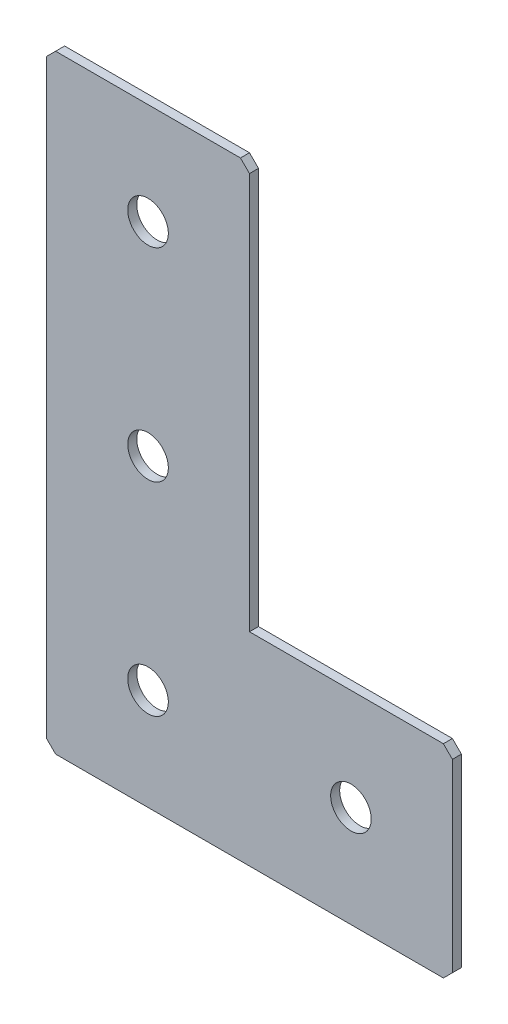
ISO-10303-21;
HEADER;
FILE_DESCRIPTION(('STEP AP214'),'2;1');
FILE_NAME('part.step','',(''),(''),'','','');
FILE_SCHEMA(('AUTOMOTIVE_DESIGN { 1 0 10303 214 1 1 1 1 }'));
ENDSEC;
DATA;
#1=APPLICATION_CONTEXT('core data for automotive mechanical design processes');
#2=APPLICATION_PROTOCOL_DEFINITION('international standard','automotive_design',2000,#1);
#3=PRODUCT_CONTEXT('',#1,'mechanical');
#4=PRODUCT('Part','Part','',(#3));
#5=PRODUCT_RELATED_PRODUCT_CATEGORY('part','',(#4));
#6=PRODUCT_DEFINITION_FORMATION('','',#4);
#7=PRODUCT_DEFINITION_CONTEXT('part definition',#1,'design');
#8=PRODUCT_DEFINITION('design','',#6,#7);
#9=PRODUCT_DEFINITION_SHAPE('','',#8);
#10=(LENGTH_UNIT() NAMED_UNIT(*) SI_UNIT(.MILLI.,.METRE.));
#11=(NAMED_UNIT(*) PLANE_ANGLE_UNIT() SI_UNIT($,.RADIAN.));
#12=(NAMED_UNIT(*) SI_UNIT($,.STERADIAN.) SOLID_ANGLE_UNIT());
#13=UNCERTAINTY_MEASURE_WITH_UNIT(LENGTH_MEASURE(1.E-05),#10,'distance_accuracy_value','');
#14=(GEOMETRIC_REPRESENTATION_CONTEXT(3) GLOBAL_UNCERTAINTY_ASSIGNED_CONTEXT((#13)) GLOBAL_UNIT_ASSIGNED_CONTEXT((#10,
#11,#12)) REPRESENTATION_CONTEXT('',''));
#15=CARTESIAN_POINT('',(0.,0.,0.));
#16=DIRECTION('',(0.,0.,1.));
#17=DIRECTION('',(1.,0.,0.));
#18=AXIS2_PLACEMENT_3D('',#15,#16,#17);
#19=CARTESIAN_POINT('',(45.,0.,-2.));
#20=DIRECTION('',(0.,-1.,0.));
#21=DIRECTION('',(1.,0.,0.));
#22=AXIS2_PLACEMENT_3D('',#19,#20,#21);
#23=PLANE('',#22);
#24=DIRECTION('',(1.,0.,0.));
#25=VECTOR('',#24,1.);
#26=CARTESIAN_POINT('',(45.,0.,-2.));
#27=LINE('',#26,#25);
#28=CARTESIAN_POINT('',(2.,0.,-2.));
#29=VERTEX_POINT('',#28);
#30=CARTESIAN_POINT('',(43.,0.,-2.));
#31=VERTEX_POINT('',#30);
#32=EDGE_CURVE('E143',#29,#31,#27,.T.);
#33=ORIENTED_EDGE('',*,*,#32,.F.);
#34=DIRECTION('',(0.,0.,1.));
#35=VECTOR('',#34,1.);
#36=CARTESIAN_POINT('',(1.99999999999999,0.,-2.));
#37=LINE('',#36,#35);
#38=CARTESIAN_POINT('',(2.,0.,0.));
#39=VERTEX_POINT('',#38);
#40=EDGE_CURVE('E197',#29,#39,#37,.T.);
#41=ORIENTED_EDGE('',*,*,#40,.T.);
#42=DIRECTION('',(1.,0.,0.));
#43=VECTOR('',#42,1.);
#44=CARTESIAN_POINT('',(45.,0.,0.));
#45=LINE('',#44,#43);
#46=CARTESIAN_POINT('',(43.,0.,0.));
#47=VERTEX_POINT('',#46);
#48=EDGE_CURVE('E174',#39,#47,#45,.T.);
#49=ORIENTED_EDGE('',*,*,#48,.T.);
#50=DIRECTION('',(0.,0.,-1.));
#51=VECTOR('',#50,1.);
#52=CARTESIAN_POINT('',(43.,0.,-2.));
#53=LINE('',#52,#51);
#54=EDGE_CURVE('E154',#47,#31,#53,.T.);
#55=ORIENTED_EDGE('',*,*,#54,.T.);
#56=EDGE_LOOP('',(#33,#41,#49,#55));
#57=FACE_BOUND('',#56,.T.);
#58=ADVANCED_FACE('F45',(#57),#23,.F.);
#59=CARTESIAN_POINT('',(45.,-90.,-2.));
#60=DIRECTION('',(-1.,0.,0.));
#61=DIRECTION('',(0.,-1.,0.));
#62=AXIS2_PLACEMENT_3D('',#59,#60,#61);
#63=PLANE('',#62);
#64=DIRECTION('',(0.,-1.,0.));
#65=VECTOR('',#64,1.);
#66=CARTESIAN_POINT('',(45.,-90.,-2.));
#67=LINE('',#66,#65);
#68=CARTESIAN_POINT('',(45.,-2.00000000000003,-2.));
#69=VERTEX_POINT('',#68);
#70=CARTESIAN_POINT('',(45.,-90.,-2.));
#71=VERTEX_POINT('',#70);
#72=EDGE_CURVE('E129',#69,#71,#67,.T.);
#73=ORIENTED_EDGE('',*,*,#72,.F.);
#74=DIRECTION('',(0.,0.,1.));
#75=VECTOR('',#74,1.);
#76=CARTESIAN_POINT('',(45.,-2.,-2.));
#77=LINE('',#76,#75);
#78=CARTESIAN_POINT('',(45.,-2.00000000000003,0.));
#79=VERTEX_POINT('',#78);
#80=EDGE_CURVE('E236',#69,#79,#77,.T.);
#81=ORIENTED_EDGE('',*,*,#80,.T.);
#82=DIRECTION('',(0.,-1.,0.));
#83=VECTOR('',#82,1.);
#84=CARTESIAN_POINT('',(45.,-90.,0.));
#85=LINE('',#84,#83);
#86=CARTESIAN_POINT('',(45.,-90.,0.));
#87=VERTEX_POINT('',#86);
#88=EDGE_CURVE('E149',#79,#87,#85,.T.);
#89=ORIENTED_EDGE('',*,*,#88,.T.);
#90=DIRECTION('',(0.,0.,1.));
#91=VECTOR('',#90,1.);
#92=CARTESIAN_POINT('',(45.,-90.,-2.));
#93=LINE('',#92,#91);
#94=EDGE_CURVE('E146',#71,#87,#93,.T.);
#95=ORIENTED_EDGE('',*,*,#94,.F.);
#96=EDGE_LOOP('',(#73,#81,#89,#95));
#97=FACE_BOUND('',#96,.T.);
#98=ADVANCED_FACE('F147',(#97),#63,.F.);
#99=CARTESIAN_POINT('',(90.,-90.,-2.));
#100=DIRECTION('',(0.,-1.,0.));
#101=DIRECTION('',(0.,0.,-1.));
#102=AXIS2_PLACEMENT_3D('',#99,#100,#101);
#103=PLANE('',#102);
#104=DIRECTION('',(1.,0.,0.));
#105=VECTOR('',#104,1.);
#106=CARTESIAN_POINT('',(90.,-90.,0.));
#107=LINE('',#106,#105);
#108=CARTESIAN_POINT('',(88.,-90.,0.));
#109=VERTEX_POINT('',#108);
#110=EDGE_CURVE('E181',#87,#109,#107,.T.);
#111=ORIENTED_EDGE('',*,*,#110,.T.);
#112=DIRECTION('',(0.,0.,-1.));
#113=VECTOR('',#112,1.);
#114=CARTESIAN_POINT('',(88.,-90.,-2.));
#115=LINE('',#114,#113);
#116=CARTESIAN_POINT('',(88.,-90.,-2.));
#117=VERTEX_POINT('',#116);
#118=EDGE_CURVE('E159',#109,#117,#115,.T.);
#119=ORIENTED_EDGE('',*,*,#118,.T.);
#120=DIRECTION('',(1.,0.,0.));
#121=VECTOR('',#120,1.);
#122=CARTESIAN_POINT('',(90.,-90.,-2.));
#123=LINE('',#122,#121);
#124=EDGE_CURVE('E134',#71,#117,#123,.T.);
#125=ORIENTED_EDGE('',*,*,#124,.F.);
#126=ORIENTED_EDGE('',*,*,#94,.T.);
#127=EDGE_LOOP('',(#111,#119,#125,#126));
#128=FACE_BOUND('',#127,.T.);
#129=ADVANCED_FACE('F157',(#128),#103,.F.);
#130=CARTESIAN_POINT('',(90.,-135.,-2.));
#131=DIRECTION('',(-1.,0.,0.));
#132=DIRECTION('',(0.,0.,1.));
#133=AXIS2_PLACEMENT_3D('',#130,#131,#132);
#134=PLANE('',#133);
#135=DIRECTION('',(0.,-1.,0.));
#136=VECTOR('',#135,1.);
#137=CARTESIAN_POINT('',(90.,-135.,-2.));
#138=LINE('',#137,#136);
#139=CARTESIAN_POINT('',(90.,-92.,-2.));
#140=VERTEX_POINT('',#139);
#141=CARTESIAN_POINT('',(90.,-133.,-2.));
#142=VERTEX_POINT('',#141);
#143=EDGE_CURVE('E161',#140,#142,#138,.T.);
#144=ORIENTED_EDGE('',*,*,#143,.F.);
#145=DIRECTION('',(0.,0.,1.));
#146=VECTOR('',#145,1.);
#147=CARTESIAN_POINT('',(90.,-92.,-2.));
#148=LINE('',#147,#146);
#149=CARTESIAN_POINT('',(90.,-92.,0.));
#150=VERTEX_POINT('',#149);
#151=EDGE_CURVE('E242',#140,#150,#148,.T.);
#152=ORIENTED_EDGE('',*,*,#151,.T.);
#153=DIRECTION('',(0.,-1.,0.));
#154=VECTOR('',#153,1.);
#155=CARTESIAN_POINT('',(90.,-135.,0.));
#156=LINE('',#155,#154);
#157=CARTESIAN_POINT('',(90.,-133.,0.));
#158=VERTEX_POINT('',#157);
#159=EDGE_CURVE('E184',#150,#158,#156,.T.);
#160=ORIENTED_EDGE('',*,*,#159,.T.);
#161=DIRECTION('',(0.,0.,-1.));
#162=VECTOR('',#161,1.);
#163=CARTESIAN_POINT('',(90.,-133.,-2.));
#164=LINE('',#163,#162);
#165=EDGE_CURVE('E239',#158,#142,#164,.T.);
#166=ORIENTED_EDGE('',*,*,#165,.T.);
#167=EDGE_LOOP('',(#144,#152,#160,#166));
#168=FACE_BOUND('',#167,.T.);
#169=ADVANCED_FACE('F376',(#168),#134,.F.);
#170=CARTESIAN_POINT('',(0.,-135.,-2.));
#171=DIRECTION('',(0.,1.,0.));
#172=DIRECTION('',(0.,0.,1.));
#173=AXIS2_PLACEMENT_3D('',#170,#171,#172);
#174=PLANE('',#173);
#175=DIRECTION('',(-1.,0.,0.));
#176=VECTOR('',#175,1.);
#177=CARTESIAN_POINT('',(0.,-135.,-2.));
#178=LINE('',#177,#176);
#179=CARTESIAN_POINT('',(88.,-135.,-2.));
#180=VERTEX_POINT('',#179);
#181=CARTESIAN_POINT('',(2.,-135.,-2.));
#182=VERTEX_POINT('',#181);
#183=EDGE_CURVE('E166',#180,#182,#178,.T.);
#184=ORIENTED_EDGE('',*,*,#183,.F.);
#185=DIRECTION('',(0.,0.,1.));
#186=VECTOR('',#185,1.);
#187=CARTESIAN_POINT('',(88.,-135.,-2.));
#188=LINE('',#187,#186);
#189=CARTESIAN_POINT('',(88.,-135.,0.));
#190=VERTEX_POINT('',#189);
#191=EDGE_CURVE('E11',#180,#190,#188,.T.);
#192=ORIENTED_EDGE('',*,*,#191,.T.);
#193=DIRECTION('',(-1.,0.,0.));
#194=VECTOR('',#193,1.);
#195=CARTESIAN_POINT('',(0.,-135.,0.));
#196=LINE('',#195,#194);
#197=CARTESIAN_POINT('',(2.,-135.,0.));
#198=VERTEX_POINT('',#197);
#199=EDGE_CURVE('E188',#190,#198,#196,.T.);
#200=ORIENTED_EDGE('',*,*,#199,.T.);
#201=DIRECTION('',(0.,0.,-1.));
#202=VECTOR('',#201,1.);
#203=CARTESIAN_POINT('',(2.,-135.,-2.));
#204=LINE('',#203,#202);
#205=EDGE_CURVE('E54',#198,#182,#204,.T.);
#206=ORIENTED_EDGE('',*,*,#205,.T.);
#207=EDGE_LOOP('',(#184,#192,#200,#206));
#208=FACE_BOUND('',#207,.T.);
#209=ADVANCED_FACE('F382',(#208),#174,.F.);
#210=CARTESIAN_POINT('',(0.,0.,-2.));
#211=DIRECTION('',(1.,0.,0.));
#212=DIRECTION('',(0.,0.,-1.));
#213=AXIS2_PLACEMENT_3D('',#210,#211,#212);
#214=PLANE('',#213);
#215=DIRECTION('',(0.,1.,0.));
#216=VECTOR('',#215,1.);
#217=CARTESIAN_POINT('',(0.,0.,0.));
#218=LINE('',#217,#216);
#219=CARTESIAN_POINT('',(0.,-133.,0.));
#220=VERTEX_POINT('',#219);
#221=CARTESIAN_POINT('',(0.,-2.,0.));
#222=VERTEX_POINT('',#221);
#223=EDGE_CURVE('E191',#220,#222,#218,.T.);
#224=ORIENTED_EDGE('',*,*,#223,.T.);
#225=DIRECTION('',(0.,0.,-1.));
#226=VECTOR('',#225,1.);
#227=CARTESIAN_POINT('',(0.,-2.,-2.));
#228=LINE('',#227,#226);
#229=CARTESIAN_POINT('',(0.,-2.,-2.));
#230=VERTEX_POINT('',#229);
#231=EDGE_CURVE('E220',#222,#230,#228,.T.);
#232=ORIENTED_EDGE('',*,*,#231,.T.);
#233=DIRECTION('',(0.,1.,0.));
#234=VECTOR('',#233,1.);
#235=CARTESIAN_POINT('',(0.,0.,-2.));
#236=LINE('',#235,#234);
#237=CARTESIAN_POINT('',(0.,-133.,-2.));
#238=VERTEX_POINT('',#237);
#239=EDGE_CURVE('E155',#238,#230,#236,.T.);
#240=ORIENTED_EDGE('',*,*,#239,.F.);
#241=DIRECTION('',(0.,0.,1.));
#242=VECTOR('',#241,1.);
#243=CARTESIAN_POINT('',(0.,-133.,-2.));
#244=LINE('',#243,#242);
#245=EDGE_CURVE('E216',#238,#220,#244,.T.);
#246=ORIENTED_EDGE('',*,*,#245,.T.);
#247=EDGE_LOOP('',(#224,#232,#240,#246));
#248=FACE_BOUND('',#247,.T.);
#249=ADVANCED_FACE('F389',(#248),#214,.F.);
#250=CARTESIAN_POINT('',(0.,0.,-2.));
#251=DIRECTION('',(0.,0.,1.));
#252=DIRECTION('',(1.,0.,0.));
#253=AXIS2_PLACEMENT_3D('',#250,#251,#252);
#254=PLANE('',#253);
#255=CARTESIAN_POINT('',(67.5,-112.5,-2.00000000000001));
#256=DIRECTION('',(0.,0.,-1.));
#257=DIRECTION('',(0.,1.,0.));
#258=AXIS2_PLACEMENT_3D('',#255,#256,#257);
#259=CIRCLE('',#258,4.5);
#260=CARTESIAN_POINT('',(67.5,-108.,-2.00000000000001));
#261=VERTEX_POINT('',#260);
#262=EDGE_CURVE('E311',#261,#261,#259,.T.);
#263=ORIENTED_EDGE('',*,*,#262,.F.);
#264=EDGE_LOOP('',(#263));
#265=FACE_BOUND('',#264,.T.);
#266=CARTESIAN_POINT('',(22.5,-112.5,-2.00000000000001));
#267=DIRECTION('',(0.,0.,-1.));
#268=DIRECTION('',(0.,1.,0.));
#269=AXIS2_PLACEMENT_3D('',#266,#267,#268);
#270=CIRCLE('',#269,4.5);
#271=CARTESIAN_POINT('',(22.5,-108.,-2.00000000000001));
#272=VERTEX_POINT('',#271);
#273=EDGE_CURVE('E322',#272,#272,#270,.T.);
#274=ORIENTED_EDGE('',*,*,#273,.F.);
#275=EDGE_LOOP('',(#274));
#276=FACE_BOUND('',#275,.T.);
#277=CARTESIAN_POINT('',(22.5,-67.5,-2.));
#278=DIRECTION('',(0.,0.,-1.));
#279=DIRECTION('',(0.,1.,0.));
#280=AXIS2_PLACEMENT_3D('',#277,#278,#279);
#281=CIRCLE('',#280,4.5);
#282=CARTESIAN_POINT('',(22.5,-63.,-2.));
#283=VERTEX_POINT('',#282);
#284=EDGE_CURVE('E333',#283,#283,#281,.T.);
#285=ORIENTED_EDGE('',*,*,#284,.F.);
#286=EDGE_LOOP('',(#285));
#287=FACE_BOUND('',#286,.T.);
#288=CARTESIAN_POINT('',(22.5,-22.5,-2.));
#289=DIRECTION('',(0.,0.,-1.));
#290=DIRECTION('',(0.,1.,0.));
#291=AXIS2_PLACEMENT_3D('',#288,#289,#290);
#292=CIRCLE('',#291,4.5);
#293=CARTESIAN_POINT('',(22.5,-18.,-2.));
#294=VERTEX_POINT('',#293);
#295=EDGE_CURVE('E343',#294,#294,#292,.T.);
#296=ORIENTED_EDGE('',*,*,#295,.F.);
#297=EDGE_LOOP('',(#296));
#298=FACE_BOUND('',#297,.T.);
#299=ORIENTED_EDGE('',*,*,#239,.T.);
#300=DIRECTION('',(-0.707106781186545,-0.70710678118655,0.));
#301=VECTOR('',#300,1.);
#302=CARTESIAN_POINT('',(1.99999999999999,0.,-2.));
#303=LINE('',#302,#301);
#304=EDGE_CURVE('E233',#230,#29,#303,.F.);
#305=ORIENTED_EDGE('',*,*,#304,.T.);
#306=ORIENTED_EDGE('',*,*,#32,.T.);
#307=DIRECTION('',(-0.70710678118655,0.707106781186545,0.));
#308=VECTOR('',#307,1.);
#309=CARTESIAN_POINT('',(45.,-2.,-2.));
#310=LINE('',#309,#308);
#311=EDGE_CURVE('E138',#31,#69,#310,.F.);
#312=ORIENTED_EDGE('',*,*,#311,.T.);
#313=ORIENTED_EDGE('',*,*,#72,.T.);
#314=ORIENTED_EDGE('',*,*,#124,.T.);
#315=DIRECTION('',(-0.707106781186552,0.707106781186543,0.));
#316=VECTOR('',#315,1.);
#317=CARTESIAN_POINT('',(90.,-92.,-2.));
#318=LINE('',#317,#316);
#319=EDGE_CURVE('E228',#117,#140,#318,.F.);
#320=ORIENTED_EDGE('',*,*,#319,.T.);
#321=ORIENTED_EDGE('',*,*,#143,.T.);
#322=DIRECTION('',(0.707106781186543,0.707106781186552,0.));
#323=VECTOR('',#322,1.);
#324=CARTESIAN_POINT('',(88.,-135.,-2.));
#325=LINE('',#324,#323);
#326=EDGE_CURVE('E67',#142,#180,#325,.F.);
#327=ORIENTED_EDGE('',*,*,#326,.T.);
#328=ORIENTED_EDGE('',*,*,#183,.T.);
#329=DIRECTION('',(0.707106781186548,-0.707106781186548,0.));
#330=VECTOR('',#329,1.);
#331=CARTESIAN_POINT('',(0.,-133.,-2.));
#332=LINE('',#331,#330);
#333=EDGE_CURVE('E223',#182,#238,#332,.F.);
#334=ORIENTED_EDGE('',*,*,#333,.T.);
#335=EDGE_LOOP('',(#299,#305,#306,#312,#313,#314,#320,#321,#327,#328,#334));
#336=FACE_BOUND('',#335,.T.);
#337=ADVANCED_FACE('F132',(#265,#276,#287,#298,#336),#254,.F.);
#338=CARTESIAN_POINT('',(0.,0.,0.));
#339=DIRECTION('',(0.,0.,1.));
#340=DIRECTION('',(1.,0.,0.));
#341=AXIS2_PLACEMENT_3D('',#338,#339,#340);
#342=PLANE('',#341);
#343=CARTESIAN_POINT('',(67.5,-112.5,0.));
#344=DIRECTION('',(0.,0.,-1.));
#345=DIRECTION('',(0.,1.,0.));
#346=AXIS2_PLACEMENT_3D('',#343,#344,#345);
#347=CIRCLE('',#346,4.5);
#348=CARTESIAN_POINT('',(67.5,-108.,0.));
#349=VERTEX_POINT('',#348);
#350=EDGE_CURVE('E314',#349,#349,#347,.T.);
#351=ORIENTED_EDGE('',*,*,#350,.T.);
#352=EDGE_LOOP('',(#351));
#353=FACE_BOUND('',#352,.T.);
#354=CARTESIAN_POINT('',(22.5,-112.5,0.));
#355=DIRECTION('',(0.,0.,-1.));
#356=DIRECTION('',(0.,1.,0.));
#357=AXIS2_PLACEMENT_3D('',#354,#355,#356);
#358=CIRCLE('',#357,4.5);
#359=CARTESIAN_POINT('',(22.5,-108.,0.));
#360=VERTEX_POINT('',#359);
#361=EDGE_CURVE('E328',#360,#360,#358,.T.);
#362=ORIENTED_EDGE('',*,*,#361,.T.);
#363=EDGE_LOOP('',(#362));
#364=FACE_BOUND('',#363,.T.);
#365=CARTESIAN_POINT('',(22.5,-67.5,0.));
#366=DIRECTION('',(0.,0.,-1.));
#367=DIRECTION('',(0.,1.,0.));
#368=AXIS2_PLACEMENT_3D('',#365,#366,#367);
#369=CIRCLE('',#368,4.5);
#370=CARTESIAN_POINT('',(22.5,-63.,0.));
#371=VERTEX_POINT('',#370);
#372=EDGE_CURVE('E338',#371,#371,#369,.T.);
#373=ORIENTED_EDGE('',*,*,#372,.T.);
#374=EDGE_LOOP('',(#373));
#375=FACE_BOUND('',#374,.T.);
#376=CARTESIAN_POINT('',(22.5,-22.5,0.));
#377=DIRECTION('',(0.,0.,-1.));
#378=DIRECTION('',(0.,1.,0.));
#379=AXIS2_PLACEMENT_3D('',#376,#377,#378);
#380=CIRCLE('',#379,4.5);
#381=CARTESIAN_POINT('',(22.5,-18.,0.));
#382=VERTEX_POINT('',#381);
#383=EDGE_CURVE('E178',#382,#382,#380,.T.);
#384=ORIENTED_EDGE('',*,*,#383,.T.);
#385=EDGE_LOOP('',(#384));
#386=FACE_BOUND('',#385,.T.);
#387=ORIENTED_EDGE('',*,*,#48,.F.);
#388=DIRECTION('',(0.707106781186545,0.70710678118655,0.));
#389=VECTOR('',#388,1.);
#390=CARTESIAN_POINT('',(1.,-0.999999999999994,0.));
#391=LINE('',#390,#389);
#392=EDGE_CURVE('E213',#39,#222,#391,.F.);
#393=ORIENTED_EDGE('',*,*,#392,.T.);
#394=ORIENTED_EDGE('',*,*,#223,.F.);
#395=DIRECTION('',(-0.707106781186548,0.707106781186548,0.));
#396=VECTOR('',#395,1.);
#397=CARTESIAN_POINT('',(-66.5,-66.5,0.));
#398=LINE('',#397,#396);
#399=EDGE_CURVE('E201',#220,#198,#398,.F.);
#400=ORIENTED_EDGE('',*,*,#399,.T.);
#401=ORIENTED_EDGE('',*,*,#199,.F.);
#402=DIRECTION('',(-0.707106781186543,-0.707106781186552,0.));
#403=VECTOR('',#402,1.);
#404=CARTESIAN_POINT('',(111.500000000001,-111.499999999999,0.));
#405=LINE('',#404,#403);
#406=EDGE_CURVE('E204',#190,#158,#405,.F.);
#407=ORIENTED_EDGE('',*,*,#406,.T.);
#408=ORIENTED_EDGE('',*,*,#159,.F.);
#409=DIRECTION('',(0.707106781186552,-0.707106781186543,0.));
#410=VECTOR('',#409,1.);
#411=CARTESIAN_POINT('',(-1.00000000000063,-1.00000000000064,0.));
#412=LINE('',#411,#410);
#413=EDGE_CURVE('E207',#150,#109,#412,.F.);
#414=ORIENTED_EDGE('',*,*,#413,.T.);
#415=ORIENTED_EDGE('',*,*,#110,.F.);
#416=ORIENTED_EDGE('',*,*,#88,.F.);
#417=DIRECTION('',(0.70710678118655,-0.707106781186545,0.));
#418=VECTOR('',#417,1.);
#419=CARTESIAN_POINT('',(21.4999999999998,21.5,0.));
#420=LINE('',#419,#418);
#421=EDGE_CURVE('E210',#79,#47,#420,.F.);
#422=ORIENTED_EDGE('',*,*,#421,.T.);
#423=EDGE_LOOP('',(#387,#393,#394,#400,#401,#407,#408,#414,#415,#416,#422));
#424=FACE_BOUND('',#423,.T.);
#425=ADVANCED_FACE('F369',(#353,#364,#375,#386,#424),#342,.T.);
#426=CARTESIAN_POINT('',(22.5,-22.5,-2.));
#427=DIRECTION('',(0.,0.,-1.));
#428=DIRECTION('',(0.,1.,0.));
#429=AXIS2_PLACEMENT_3D('',#426,#427,#428);
#430=CYLINDRICAL_SURFACE('',#429,4.5);
#431=ORIENTED_EDGE('',*,*,#383,.F.);
#432=EDGE_LOOP('',(#431));
#433=FACE_BOUND('',#432,.T.);
#434=ORIENTED_EDGE('',*,*,#295,.T.);
#435=EDGE_LOOP('',(#434));
#436=FACE_BOUND('',#435,.T.);
#437=ADVANCED_FACE('F457',(#433,#436),#430,.F.);
#438=CARTESIAN_POINT('',(22.5,-67.5,-2.));
#439=DIRECTION('',(0.,0.,-1.));
#440=DIRECTION('',(0.,1.,0.));
#441=AXIS2_PLACEMENT_3D('',#438,#439,#440);
#442=CYLINDRICAL_SURFACE('',#441,4.5);
#443=ORIENTED_EDGE('',*,*,#372,.F.);
#444=EDGE_LOOP('',(#443));
#445=FACE_BOUND('',#444,.T.);
#446=ORIENTED_EDGE('',*,*,#284,.T.);
#447=EDGE_LOOP('',(#446));
#448=FACE_BOUND('',#447,.T.);
#449=ADVANCED_FACE('F448',(#445,#448),#442,.F.);
#450=CARTESIAN_POINT('',(22.5,-112.5,-2.00000000000001));
#451=DIRECTION('',(0.,0.,-1.));
#452=DIRECTION('',(0.,1.,0.));
#453=AXIS2_PLACEMENT_3D('',#450,#451,#452);
#454=CYLINDRICAL_SURFACE('',#453,4.5);
#455=ORIENTED_EDGE('',*,*,#361,.F.);
#456=EDGE_LOOP('',(#455));
#457=FACE_BOUND('',#456,.T.);
#458=ORIENTED_EDGE('',*,*,#273,.T.);
#459=EDGE_LOOP('',(#458));
#460=FACE_BOUND('',#459,.T.);
#461=ADVANCED_FACE('F439',(#457,#460),#454,.F.);
#462=CARTESIAN_POINT('',(67.5,-112.5,-2.00000000000001));
#463=DIRECTION('',(0.,0.,-1.));
#464=DIRECTION('',(0.,1.,0.));
#465=AXIS2_PLACEMENT_3D('',#462,#463,#464);
#466=CYLINDRICAL_SURFACE('',#465,4.5);
#467=ORIENTED_EDGE('',*,*,#350,.F.);
#468=EDGE_LOOP('',(#467));
#469=FACE_BOUND('',#468,.T.);
#470=ORIENTED_EDGE('',*,*,#262,.T.);
#471=EDGE_LOOP('',(#470));
#472=FACE_BOUND('',#471,.T.);
#473=ADVANCED_FACE('F403',(#469,#472),#466,.F.);
#474=CARTESIAN_POINT('',(1.99999999999999,0.,-2.));
#475=DIRECTION('',(0.70710678118655,-0.707106781186545,0.));
#476=DIRECTION('',(0.,0.,1.));
#477=AXIS2_PLACEMENT_3D('',#474,#475,#476);
#478=PLANE('',#477);
#479=ORIENTED_EDGE('',*,*,#304,.F.);
#480=ORIENTED_EDGE('',*,*,#231,.F.);
#481=ORIENTED_EDGE('',*,*,#392,.F.);
#482=ORIENTED_EDGE('',*,*,#40,.F.);
#483=EDGE_LOOP('',(#479,#480,#481,#482));
#484=FACE_BOUND('',#483,.T.);
#485=ADVANCED_FACE('F392',(#484),#478,.F.);
#486=CARTESIAN_POINT('',(45.,-2.,-2.));
#487=DIRECTION('',(-0.707106781186545,-0.70710678118655,0.));
#488=DIRECTION('',(0.,0.,1.));
#489=AXIS2_PLACEMENT_3D('',#486,#487,#488);
#490=PLANE('',#489);
#491=ORIENTED_EDGE('',*,*,#311,.F.);
#492=ORIENTED_EDGE('',*,*,#54,.F.);
#493=ORIENTED_EDGE('',*,*,#421,.F.);
#494=ORIENTED_EDGE('',*,*,#80,.F.);
#495=EDGE_LOOP('',(#491,#492,#493,#494));
#496=FACE_BOUND('',#495,.T.);
#497=ADVANCED_FACE('F366',(#496),#490,.F.);
#498=CARTESIAN_POINT('',(90.,-92.,-2.));
#499=DIRECTION('',(-0.707106781186542,-0.707106781186552,0.));
#500=DIRECTION('',(0.,0.,1.));
#501=AXIS2_PLACEMENT_3D('',#498,#499,#500);
#502=PLANE('',#501);
#503=ORIENTED_EDGE('',*,*,#319,.F.);
#504=ORIENTED_EDGE('',*,*,#118,.F.);
#505=ORIENTED_EDGE('',*,*,#413,.F.);
#506=ORIENTED_EDGE('',*,*,#151,.F.);
#507=EDGE_LOOP('',(#503,#504,#505,#506));
#508=FACE_BOUND('',#507,.T.);
#509=ADVANCED_FACE('F372',(#508),#502,.F.);
#510=CARTESIAN_POINT('',(88.,-135.,-2.));
#511=DIRECTION('',(-0.707106781186552,0.707106781186542,0.));
#512=DIRECTION('',(0.,0.,1.));
#513=AXIS2_PLACEMENT_3D('',#510,#511,#512);
#514=PLANE('',#513);
#515=ORIENTED_EDGE('',*,*,#326,.F.);
#516=ORIENTED_EDGE('',*,*,#165,.F.);
#517=ORIENTED_EDGE('',*,*,#406,.F.);
#518=ORIENTED_EDGE('',*,*,#191,.F.);
#519=EDGE_LOOP('',(#515,#516,#517,#518));
#520=FACE_BOUND('',#519,.T.);
#521=ADVANCED_FACE('F379',(#520),#514,.F.);
#522=CARTESIAN_POINT('',(0.,-133.,-2.));
#523=DIRECTION('',(0.707106781186547,0.707106781186547,0.));
#524=DIRECTION('',(0.,0.,1.));
#525=AXIS2_PLACEMENT_3D('',#522,#523,#524);
#526=PLANE('',#525);
#527=ORIENTED_EDGE('',*,*,#333,.F.);
#528=ORIENTED_EDGE('',*,*,#205,.F.);
#529=ORIENTED_EDGE('',*,*,#399,.F.);
#530=ORIENTED_EDGE('',*,*,#245,.F.);
#531=EDGE_LOOP('',(#527,#528,#529,#530));
#532=FACE_BOUND('',#531,.T.);
#533=ADVANCED_FACE('F47',(#532),#526,.F.);
#534=CLOSED_SHELL('',(#58,#98,#129,#169,#209,#249,#337,#425,#437,#449,#461,#473,#485,#497,#509,
#521,#533));
#535=MANIFOLD_SOLID_BREP('B2',#534);
#536=ADVANCED_BREP_SHAPE_REPRESENTATION('',(#18,#535),#14);
#537=SHAPE_DEFINITION_REPRESENTATION(#9,#536);
ENDSEC;
END-ISO-10303-21;
